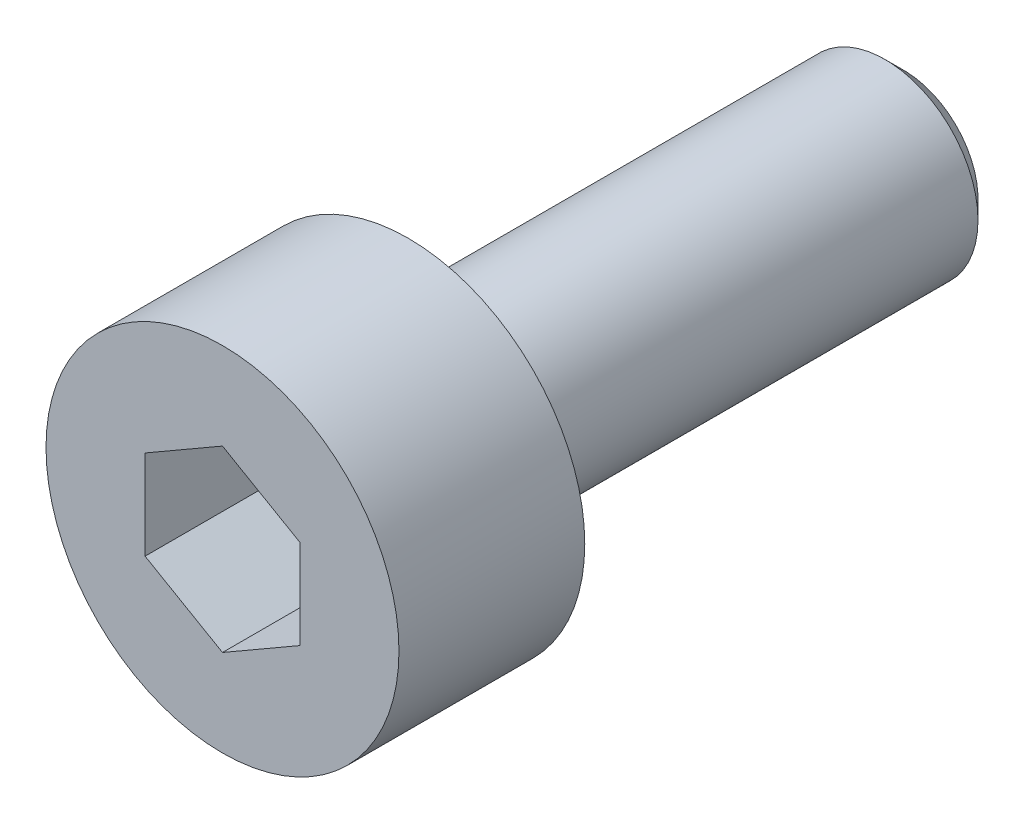
ISO-10303-21;
HEADER;
FILE_DESCRIPTION(('STEP AP214'),'2;1');
FILE_NAME('part.step','',(''),(''),'','','');
FILE_SCHEMA(('AUTOMOTIVE_DESIGN { 1 0 10303 214 1 1 1 1 }'));
ENDSEC;
DATA;
#1=APPLICATION_CONTEXT('core data for automotive mechanical design processes');
#2=APPLICATION_PROTOCOL_DEFINITION('international standard','automotive_design',2000,#1);
#3=PRODUCT_CONTEXT('',#1,'mechanical');
#4=PRODUCT('Part','Part','',(#3));
#5=PRODUCT_RELATED_PRODUCT_CATEGORY('part','',(#4));
#6=PRODUCT_DEFINITION_FORMATION('','',#4);
#7=PRODUCT_DEFINITION_CONTEXT('part definition',#1,'design');
#8=PRODUCT_DEFINITION('design','',#6,#7);
#9=PRODUCT_DEFINITION_SHAPE('','',#8);
#10=(LENGTH_UNIT() NAMED_UNIT(*) SI_UNIT(.MILLI.,.METRE.));
#11=(NAMED_UNIT(*) PLANE_ANGLE_UNIT() SI_UNIT($,.RADIAN.));
#12=(NAMED_UNIT(*) SI_UNIT($,.STERADIAN.) SOLID_ANGLE_UNIT());
#13=UNCERTAINTY_MEASURE_WITH_UNIT(LENGTH_MEASURE(1.E-05),#10,'distance_accuracy_value','');
#14=(GEOMETRIC_REPRESENTATION_CONTEXT(3) GLOBAL_UNCERTAINTY_ASSIGNED_CONTEXT((#13)) GLOBAL_UNIT_ASSIGNED_CONTEXT((#10,
#11,#12)) REPRESENTATION_CONTEXT('',''));
#15=CARTESIAN_POINT('',(0.,0.,0.));
#16=DIRECTION('',(0.,0.,1.));
#17=DIRECTION('',(1.,0.,0.));
#18=AXIS2_PLACEMENT_3D('',#15,#16,#17);
#19=CARTESIAN_POINT('',(0.,0.,0.));
#20=DIRECTION('',(0.,0.,1.));
#21=DIRECTION('',(1.,0.,0.));
#22=AXIS2_PLACEMENT_3D('',#19,#20,#21);
#23=PLANE('',#22);
#24=CARTESIAN_POINT('',(0.,0.,0.));
#25=DIRECTION('',(0.,0.,1.));
#26=DIRECTION('',(1.,0.,0.));
#27=AXIS2_PLACEMENT_3D('',#24,#25,#26);
#28=CIRCLE('',#27,2.85);
#29=CARTESIAN_POINT('',(2.85,0.,0.));
#30=VERTEX_POINT('',#29);
#31=EDGE_CURVE('E137',#30,#30,#28,.T.);
#32=ORIENTED_EDGE('',*,*,#31,.F.);
#33=EDGE_LOOP('',(#32));
#34=FACE_BOUND('',#33,.T.);
#35=CARTESIAN_POINT('',(0.,0.,0.));
#36=DIRECTION('',(0.,0.,1.));
#37=DIRECTION('',(1.,0.,0.));
#38=AXIS2_PLACEMENT_3D('',#35,#36,#37);
#39=CIRCLE('',#38,1.5);
#40=CARTESIAN_POINT('',(1.5,0.,0.));
#41=VERTEX_POINT('',#40);
#42=EDGE_CURVE('E146',#41,#41,#39,.F.);
#43=ORIENTED_EDGE('',*,*,#42,.F.);
#44=EDGE_LOOP('',(#43));
#45=FACE_BOUND('',#44,.T.);
#46=ADVANCED_FACE('F35',(#34,#45),#23,.F.);
#47=CARTESIAN_POINT('',(0.,0.,3.));
#48=DIRECTION('',(0.,0.,-1.));
#49=DIRECTION('',(-1.,0.,0.));
#50=AXIS2_PLACEMENT_3D('',#47,#48,#49);
#51=CYLINDRICAL_SURFACE('',#50,2.85);
#52=CARTESIAN_POINT('',(0.,0.,3.));
#53=DIRECTION('',(0.,0.,1.));
#54=DIRECTION('',(1.,0.,0.));
#55=AXIS2_PLACEMENT_3D('',#52,#53,#54);
#56=CIRCLE('',#55,2.85);
#57=CARTESIAN_POINT('',(2.85,0.,3.));
#58=VERTEX_POINT('',#57);
#59=EDGE_CURVE('E143',#58,#58,#56,.T.);
#60=ORIENTED_EDGE('',*,*,#59,.F.);
#61=EDGE_LOOP('',(#60));
#62=FACE_BOUND('',#61,.T.);
#63=ORIENTED_EDGE('',*,*,#31,.T.);
#64=EDGE_LOOP('',(#63));
#65=FACE_BOUND('',#64,.T.);
#66=ADVANCED_FACE('F168',(#62,#65),#51,.T.);
#67=CARTESIAN_POINT('',(0.,0.,3.));
#68=DIRECTION('',(0.,0.,1.));
#69=DIRECTION('',(1.,0.,0.));
#70=AXIS2_PLACEMENT_3D('',#67,#68,#69);
#71=PLANE('',#70);
#72=DIRECTION('',(-0.866025403784439,0.5,0.));
#73=VECTOR('',#72,1.);
#74=CARTESIAN_POINT('',(1.25,0.721687836487032,3.));
#75=LINE('',#74,#73);
#76=CARTESIAN_POINT('',(1.25,0.721687836487032,3.));
#77=VERTEX_POINT('',#76);
#78=CARTESIAN_POINT('',(0.,1.44337567297406,3.));
#79=VERTEX_POINT('',#78);
#80=EDGE_CURVE('E50',#77,#79,#75,.T.);
#81=ORIENTED_EDGE('',*,*,#80,.F.);
#82=DIRECTION('',(0.,1.,0.));
#83=VECTOR('',#82,1.);
#84=CARTESIAN_POINT('',(1.25,-0.721687836487032,3.));
#85=LINE('',#84,#83);
#86=CARTESIAN_POINT('',(1.25,-0.721687836487032,3.));
#87=VERTEX_POINT('',#86);
#88=EDGE_CURVE('E133',#87,#77,#85,.T.);
#89=ORIENTED_EDGE('',*,*,#88,.F.);
#90=DIRECTION('',(0.866025403784439,0.5,0.));
#91=VECTOR('',#90,1.);
#92=CARTESIAN_POINT('',(0.,-1.44337567297406,3.));
#93=LINE('',#92,#91);
#94=CARTESIAN_POINT('',(0.,-1.44337567297406,3.));
#95=VERTEX_POINT('',#94);
#96=EDGE_CURVE('E131',#95,#87,#93,.T.);
#97=ORIENTED_EDGE('',*,*,#96,.F.);
#98=DIRECTION('',(0.866025403784439,-0.5,0.));
#99=VECTOR('',#98,1.);
#100=CARTESIAN_POINT('',(-1.25,-0.721687836487033,3.));
#101=LINE('',#100,#99);
#102=CARTESIAN_POINT('',(-1.25,-0.721687836487033,3.));
#103=VERTEX_POINT('',#102);
#104=EDGE_CURVE('E98',#103,#95,#101,.T.);
#105=ORIENTED_EDGE('',*,*,#104,.F.);
#106=DIRECTION('',(0.,-1.,0.));
#107=VECTOR('',#106,1.);
#108=CARTESIAN_POINT('',(-1.25,0.721687836487032,3.));
#109=LINE('',#108,#107);
#110=CARTESIAN_POINT('',(-1.25,0.721687836487032,3.));
#111=VERTEX_POINT('',#110);
#112=EDGE_CURVE('E127',#111,#103,#109,.T.);
#113=ORIENTED_EDGE('',*,*,#112,.F.);
#114=DIRECTION('',(-0.866025403784439,-0.5,0.));
#115=VECTOR('',#114,1.);
#116=CARTESIAN_POINT('',(0.,1.44337567297406,3.));
#117=LINE('',#116,#115);
#118=EDGE_CURVE('E124',#79,#111,#117,.T.);
#119=ORIENTED_EDGE('',*,*,#118,.F.);
#120=EDGE_LOOP('',(#81,#89,#97,#105,#113,#119));
#121=FACE_BOUND('',#120,.T.);
#122=ORIENTED_EDGE('',*,*,#59,.T.);
#123=EDGE_LOOP('',(#122));
#124=FACE_BOUND('',#123,.T.);
#125=ADVANCED_FACE('F174',(#121,#124),#71,.T.);
#126=CARTESIAN_POINT('',(0.,0.,-8.));
#127=DIRECTION('',(0.,0.,1.));
#128=DIRECTION('',(1.,0.,0.));
#129=AXIS2_PLACEMENT_3D('',#126,#127,#128);
#130=CYLINDRICAL_SURFACE('',#129,1.5);
#131=CARTESIAN_POINT('',(0.,0.,-7.7));
#132=DIRECTION('',(0.,0.,-1.));
#133=DIRECTION('',(-1.,0.,0.));
#134=AXIS2_PLACEMENT_3D('',#131,#132,#133);
#135=CIRCLE('',#134,1.5);
#136=CARTESIAN_POINT('',(-1.5,0.,-7.7));
#137=VERTEX_POINT('',#136);
#138=EDGE_CURVE('E11',#137,#137,#135,.F.);
#139=ORIENTED_EDGE('',*,*,#138,.T.);
#140=EDGE_LOOP('',(#139));
#141=FACE_BOUND('',#140,.T.);
#142=ORIENTED_EDGE('',*,*,#42,.T.);
#143=EDGE_LOOP('',(#142));
#144=FACE_BOUND('',#143,.T.);
#145=ADVANCED_FACE('F164',(#141,#144),#130,.T.);
#146=CARTESIAN_POINT('',(0.,0.,-8.));
#147=DIRECTION('',(0.,0.,-1.));
#148=DIRECTION('',(-1.,0.,0.));
#149=AXIS2_PLACEMENT_3D('',#146,#147,#148);
#150=PLANE('',#149);
#151=CARTESIAN_POINT('',(0.,0.,-8.));
#152=DIRECTION('',(0.,0.,-1.));
#153=DIRECTION('',(-1.,0.,0.));
#154=AXIS2_PLACEMENT_3D('',#151,#152,#153);
#155=CIRCLE('',#154,1.2);
#156=CARTESIAN_POINT('',(-1.2,0.,-8.));
#157=VERTEX_POINT('',#156);
#158=EDGE_CURVE('E43',#157,#157,#155,.T.);
#159=ORIENTED_EDGE('',*,*,#158,.T.);
#160=EDGE_LOOP('',(#159));
#161=FACE_BOUND('',#160,.T.);
#162=ADVANCED_FACE('F153',(#161),#150,.T.);
#163=CARTESIAN_POINT('',(0.,0.,-8.));
#164=DIRECTION('',(0.,0.,1.));
#165=DIRECTION('',(1.,0.,0.));
#166=AXIS2_PLACEMENT_3D('',#163,#164,#165);
#167=CONICAL_SURFACE('',#166,1.2,0.785398163397449);
#168=ORIENTED_EDGE('',*,*,#138,.F.);
#169=EDGE_LOOP('',(#168));
#170=FACE_BOUND('',#169,.T.);
#171=ORIENTED_EDGE('',*,*,#158,.F.);
#172=EDGE_LOOP('',(#171));
#173=FACE_BOUND('',#172,.T.);
#174=ADVANCED_FACE('F37',(#170,#173),#167,.T.);
#175=CARTESIAN_POINT('',(1.25,0.721687836487032,1.));
#176=DIRECTION('',(0.5,0.866025403784439,0.));
#177=DIRECTION('',(-0.866025403784439,0.5,0.));
#178=AXIS2_PLACEMENT_3D('',#175,#176,#177);
#179=PLANE('',#178);
#180=ORIENTED_EDGE('',*,*,#80,.T.);
#181=DIRECTION('',(0.,0.,1.));
#182=VECTOR('',#181,1.);
#183=CARTESIAN_POINT('',(0.,1.44337567297406,1.));
#184=LINE('',#183,#182);
#185=CARTESIAN_POINT('',(0.,1.44337567297406,1.));
#186=VERTEX_POINT('',#185);
#187=EDGE_CURVE('E80',#186,#79,#184,.T.);
#188=ORIENTED_EDGE('',*,*,#187,.F.);
#189=DIRECTION('',(-0.866025403784439,0.5,0.));
#190=VECTOR('',#189,1.);
#191=CARTESIAN_POINT('',(1.25,0.721687836487032,1.));
#192=LINE('',#191,#190);
#193=CARTESIAN_POINT('',(1.25,0.721687836487032,1.));
#194=VERTEX_POINT('',#193);
#195=EDGE_CURVE('E135',#194,#186,#192,.T.);
#196=ORIENTED_EDGE('',*,*,#195,.F.);
#197=DIRECTION('',(0.,0.,1.));
#198=VECTOR('',#197,1.);
#199=CARTESIAN_POINT('',(1.25,0.721687836487032,1.));
#200=LINE('',#199,#198);
#201=EDGE_CURVE('E58',#194,#77,#200,.T.);
#202=ORIENTED_EDGE('',*,*,#201,.T.);
#203=EDGE_LOOP('',(#180,#188,#196,#202));
#204=FACE_BOUND('',#203,.T.);
#205=ADVANCED_FACE('F156',(#204),#179,.F.);
#206=CARTESIAN_POINT('',(1.25,-0.721687836487032,1.));
#207=DIRECTION('',(1.,0.,0.));
#208=DIRECTION('',(0.,1.,0.));
#209=AXIS2_PLACEMENT_3D('',#206,#207,#208);
#210=PLANE('',#209);
#211=ORIENTED_EDGE('',*,*,#88,.T.);
#212=ORIENTED_EDGE('',*,*,#201,.F.);
#213=DIRECTION('',(0.,1.,0.));
#214=VECTOR('',#213,1.);
#215=CARTESIAN_POINT('',(1.25,-0.721687836487032,1.));
#216=LINE('',#215,#214);
#217=CARTESIAN_POINT('',(1.25,-0.721687836487032,1.));
#218=VERTEX_POINT('',#217);
#219=EDGE_CURVE('E110',#218,#194,#216,.T.);
#220=ORIENTED_EDGE('',*,*,#219,.F.);
#221=DIRECTION('',(0.,0.,1.));
#222=VECTOR('',#221,1.);
#223=CARTESIAN_POINT('',(1.25,-0.721687836487032,1.));
#224=LINE('',#223,#222);
#225=EDGE_CURVE('E102',#218,#87,#224,.T.);
#226=ORIENTED_EDGE('',*,*,#225,.T.);
#227=EDGE_LOOP('',(#211,#212,#220,#226));
#228=FACE_BOUND('',#227,.T.);
#229=ADVANCED_FACE('F162',(#228),#210,.F.);
#230=CARTESIAN_POINT('',(0.,-1.44337567297406,1.));
#231=DIRECTION('',(0.5,-0.866025403784439,0.));
#232=DIRECTION('',(0.866025403784439,0.5,0.));
#233=AXIS2_PLACEMENT_3D('',#230,#231,#232);
#234=PLANE('',#233);
#235=ORIENTED_EDGE('',*,*,#96,.T.);
#236=ORIENTED_EDGE('',*,*,#225,.F.);
#237=DIRECTION('',(0.866025403784439,0.5,0.));
#238=VECTOR('',#237,1.);
#239=CARTESIAN_POINT('',(0.,-1.44337567297406,1.));
#240=LINE('',#239,#238);
#241=CARTESIAN_POINT('',(0.,-1.44337567297406,1.));
#242=VERTEX_POINT('',#241);
#243=EDGE_CURVE('E106',#242,#218,#240,.T.);
#244=ORIENTED_EDGE('',*,*,#243,.F.);
#245=DIRECTION('',(0.,0.,1.));
#246=VECTOR('',#245,1.);
#247=CARTESIAN_POINT('',(0.,-1.44337567297406,1.));
#248=LINE('',#247,#246);
#249=EDGE_CURVE('E91',#242,#95,#248,.T.);
#250=ORIENTED_EDGE('',*,*,#249,.T.);
#251=EDGE_LOOP('',(#235,#236,#244,#250));
#252=FACE_BOUND('',#251,.T.);
#253=ADVANCED_FACE('F107',(#252),#234,.F.);
#254=CARTESIAN_POINT('',(-1.25,-0.721687836487033,1.));
#255=DIRECTION('',(-0.5,-0.866025403784439,0.));
#256=DIRECTION('',(0.866025403784439,-0.5,0.));
#257=AXIS2_PLACEMENT_3D('',#254,#255,#256);
#258=PLANE('',#257);
#259=ORIENTED_EDGE('',*,*,#104,.T.);
#260=ORIENTED_EDGE('',*,*,#249,.F.);
#261=DIRECTION('',(0.866025403784439,-0.5,0.));
#262=VECTOR('',#261,1.);
#263=CARTESIAN_POINT('',(-1.25,-0.721687836487033,1.));
#264=LINE('',#263,#262);
#265=CARTESIAN_POINT('',(-1.25,-0.721687836487033,1.));
#266=VERTEX_POINT('',#265);
#267=EDGE_CURVE('E95',#266,#242,#264,.T.);
#268=ORIENTED_EDGE('',*,*,#267,.F.);
#269=DIRECTION('',(0.,0.,1.));
#270=VECTOR('',#269,1.);
#271=CARTESIAN_POINT('',(-1.25,-0.721687836487033,1.));
#272=LINE('',#271,#270);
#273=EDGE_CURVE('E103',#266,#103,#272,.T.);
#274=ORIENTED_EDGE('',*,*,#273,.T.);
#275=EDGE_LOOP('',(#259,#260,#268,#274));
#276=FACE_BOUND('',#275,.T.);
#277=ADVANCED_FACE('F93',(#276),#258,.F.);
#278=CARTESIAN_POINT('',(-1.25,0.721687836487032,1.));
#279=DIRECTION('',(-1.,0.,0.));
#280=DIRECTION('',(0.,0.,1.));
#281=AXIS2_PLACEMENT_3D('',#278,#279,#280);
#282=PLANE('',#281);
#283=ORIENTED_EDGE('',*,*,#112,.T.);
#284=ORIENTED_EDGE('',*,*,#273,.F.);
#285=DIRECTION('',(0.,-1.,0.));
#286=VECTOR('',#285,1.);
#287=CARTESIAN_POINT('',(-1.25,0.721687836487032,1.));
#288=LINE('',#287,#286);
#289=CARTESIAN_POINT('',(-1.25,0.721687836487032,1.));
#290=VERTEX_POINT('',#289);
#291=EDGE_CURVE('E116',#290,#266,#288,.T.);
#292=ORIENTED_EDGE('',*,*,#291,.F.);
#293=DIRECTION('',(0.,0.,1.));
#294=VECTOR('',#293,1.);
#295=CARTESIAN_POINT('',(-1.25,0.721687836487032,1.));
#296=LINE('',#295,#294);
#297=EDGE_CURVE('E140',#290,#111,#296,.T.);
#298=ORIENTED_EDGE('',*,*,#297,.T.);
#299=EDGE_LOOP('',(#283,#284,#292,#298));
#300=FACE_BOUND('',#299,.T.);
#301=ADVANCED_FACE('F188',(#300),#282,.F.);
#302=CARTESIAN_POINT('',(0.,1.44337567297406,1.));
#303=DIRECTION('',(-0.5,0.866025403784439,0.));
#304=DIRECTION('',(-0.866025403784439,-0.5,0.));
#305=AXIS2_PLACEMENT_3D('',#302,#303,#304);
#306=PLANE('',#305);
#307=ORIENTED_EDGE('',*,*,#118,.T.);
#308=ORIENTED_EDGE('',*,*,#297,.F.);
#309=DIRECTION('',(-0.866025403784439,-0.5,0.));
#310=VECTOR('',#309,1.);
#311=CARTESIAN_POINT('',(0.,1.44337567297406,1.));
#312=LINE('',#311,#310);
#313=EDGE_CURVE('E118',#186,#290,#312,.T.);
#314=ORIENTED_EDGE('',*,*,#313,.F.);
#315=ORIENTED_EDGE('',*,*,#187,.T.);
#316=EDGE_LOOP('',(#307,#308,#314,#315));
#317=FACE_BOUND('',#316,.T.);
#318=ADVANCED_FACE('F185',(#317),#306,.F.);
#319=CARTESIAN_POINT('',(0.,0.,1.));
#320=DIRECTION('',(0.,0.,1.));
#321=DIRECTION('',(1.,0.,0.));
#322=AXIS2_PLACEMENT_3D('',#319,#320,#321);
#323=PLANE('',#322);
#324=ORIENTED_EDGE('',*,*,#195,.T.);
#325=ORIENTED_EDGE('',*,*,#313,.T.);
#326=ORIENTED_EDGE('',*,*,#291,.T.);
#327=ORIENTED_EDGE('',*,*,#267,.T.);
#328=ORIENTED_EDGE('',*,*,#243,.T.);
#329=ORIENTED_EDGE('',*,*,#219,.T.);
#330=EDGE_LOOP('',(#324,#325,#326,#327,#328,#329));
#331=FACE_BOUND('',#330,.T.);
#332=ADVANCED_FACE('F113',(#331),#323,.T.);
#333=CLOSED_SHELL('',(#46,#66,#125,#145,#162,#174,#205,#229,#253,#277,#301,#318,#332));
#334=MANIFOLD_SOLID_BREP('B2',#333);
#335=ADVANCED_BREP_SHAPE_REPRESENTATION('',(#18,#334),#14);
#336=SHAPE_DEFINITION_REPRESENTATION(#9,#335);
ENDSEC;
END-ISO-10303-21;
